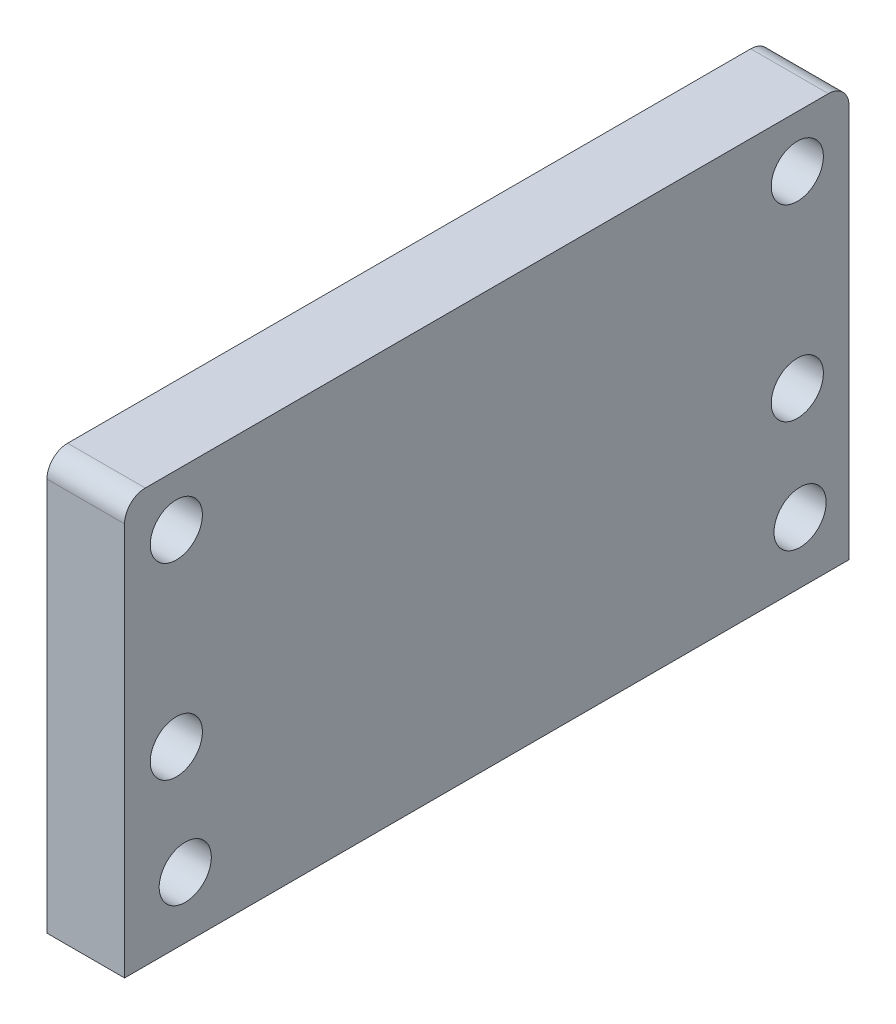
ISO-10303-21;
HEADER;
FILE_DESCRIPTION(('STEP AP214'),'2;1');
FILE_NAME('part.step','',(''),(''),'','','');
FILE_SCHEMA(('AUTOMOTIVE_DESIGN { 1 0 10303 214 1 1 1 1 }'));
ENDSEC;
DATA;
#1=APPLICATION_CONTEXT('core data for automotive mechanical design processes');
#2=APPLICATION_PROTOCOL_DEFINITION('international standard','automotive_design',2000,#1);
#3=PRODUCT_CONTEXT('',#1,'mechanical');
#4=PRODUCT('Part','Part','',(#3));
#5=PRODUCT_RELATED_PRODUCT_CATEGORY('part','',(#4));
#6=PRODUCT_DEFINITION_FORMATION('','',#4);
#7=PRODUCT_DEFINITION_CONTEXT('part definition',#1,'design');
#8=PRODUCT_DEFINITION('design','',#6,#7);
#9=PRODUCT_DEFINITION_SHAPE('','',#8);
#10=(LENGTH_UNIT() NAMED_UNIT(*) SI_UNIT(.MILLI.,.METRE.));
#11=(NAMED_UNIT(*) PLANE_ANGLE_UNIT() SI_UNIT($,.RADIAN.));
#12=(NAMED_UNIT(*) SI_UNIT($,.STERADIAN.) SOLID_ANGLE_UNIT());
#13=UNCERTAINTY_MEASURE_WITH_UNIT(LENGTH_MEASURE(1.E-05),#10,'distance_accuracy_value','');
#14=(GEOMETRIC_REPRESENTATION_CONTEXT(3) GLOBAL_UNCERTAINTY_ASSIGNED_CONTEXT((#13)) GLOBAL_UNIT_ASSIGNED_CONTEXT((#10,
#11,#12)) REPRESENTATION_CONTEXT('',''));
#15=CARTESIAN_POINT('',(0.,0.,0.));
#16=DIRECTION('',(0.,0.,1.));
#17=DIRECTION('',(1.,0.,0.));
#18=AXIS2_PLACEMENT_3D('',#15,#16,#17);
#19=CARTESIAN_POINT('',(4.7625,22.86,41.91));
#20=DIRECTION('',(-1.,0.,0.));
#21=DIRECTION('',(0.,0.,1.));
#22=AXIS2_PLACEMENT_3D('',#19,#20,#21);
#23=CYLINDRICAL_SURFACE('',#22,2.54);
#24=DIRECTION('',(-1.,0.,0.));
#25=VECTOR('',#24,1.);
#26=CARTESIAN_POINT('',(4.7625,22.86,44.45));
#27=LINE('',#26,#25);
#28=CARTESIAN_POINT('',(4.7625,22.86,44.45));
#29=VERTEX_POINT('',#28);
#30=CARTESIAN_POINT('',(-4.7625,22.86,44.45));
#31=VERTEX_POINT('',#30);
#32=EDGE_CURVE('E110',#29,#31,#27,.T.);
#33=ORIENTED_EDGE('',*,*,#32,.F.);
#34=CARTESIAN_POINT('',(4.7625,22.86,41.91));
#35=DIRECTION('',(1.,0.,0.));
#36=DIRECTION('',(0.,0.,-1.));
#37=AXIS2_PLACEMENT_3D('',#34,#35,#36);
#38=CIRCLE('',#37,2.54);
#39=CARTESIAN_POINT('',(4.7625,25.4,41.91));
#40=VERTEX_POINT('',#39);
#41=EDGE_CURVE('E91',#40,#29,#38,.T.);
#42=ORIENTED_EDGE('',*,*,#41,.F.);
#43=DIRECTION('',(-1.,0.,0.));
#44=VECTOR('',#43,1.);
#45=CARTESIAN_POINT('',(4.7625,25.4,41.91));
#46=LINE('',#45,#44);
#47=CARTESIAN_POINT('',(-4.7625,25.4,41.91));
#48=VERTEX_POINT('',#47);
#49=EDGE_CURVE('E112',#48,#40,#46,.F.);
#50=ORIENTED_EDGE('',*,*,#49,.F.);
#51=CARTESIAN_POINT('',(-4.7625,22.86,41.91));
#52=DIRECTION('',(1.,0.,0.));
#53=DIRECTION('',(0.,0.,-1.));
#54=AXIS2_PLACEMENT_3D('',#51,#52,#53);
#55=CIRCLE('',#54,2.54);
#56=EDGE_CURVE('E121',#31,#48,#55,.F.);
#57=ORIENTED_EDGE('',*,*,#56,.F.);
#58=EDGE_LOOP('',(#33,#42,#50,#57));
#59=FACE_BOUND('',#58,.T.);
#60=ADVANCED_FACE('F33',(#59),#23,.T.);
#61=CARTESIAN_POINT('',(4.7625,-25.4,44.45));
#62=DIRECTION('',(0.,0.,-1.));
#63=DIRECTION('',(-1.,0.,0.));
#64=AXIS2_PLACEMENT_3D('',#61,#62,#63);
#65=PLANE('',#64);
#66=DIRECTION('',(0.,-1.,0.));
#67=VECTOR('',#66,1.);
#68=CARTESIAN_POINT('',(4.7625,-25.4,44.45));
#69=LINE('',#68,#67);
#70=CARTESIAN_POINT('',(4.7625,-25.4,44.45));
#71=VERTEX_POINT('',#70);
#72=EDGE_CURVE('E85',#29,#71,#69,.T.);
#73=ORIENTED_EDGE('',*,*,#72,.F.);
#74=ORIENTED_EDGE('',*,*,#32,.T.);
#75=DIRECTION('',(0.,-1.,0.));
#76=VECTOR('',#75,1.);
#77=CARTESIAN_POINT('',(-4.7625,-25.4,44.45));
#78=LINE('',#77,#76);
#79=CARTESIAN_POINT('',(-4.7625,-25.4,44.45));
#80=VERTEX_POINT('',#79);
#81=EDGE_CURVE('E108',#31,#80,#78,.T.);
#82=ORIENTED_EDGE('',*,*,#81,.T.);
#83=DIRECTION('',(-1.,0.,0.));
#84=VECTOR('',#83,1.);
#85=CARTESIAN_POINT('',(4.7625,-25.4,44.45));
#86=LINE('',#85,#84);
#87=EDGE_CURVE('E101',#71,#80,#86,.T.);
#88=ORIENTED_EDGE('',*,*,#87,.F.);
#89=EDGE_LOOP('',(#73,#74,#82,#88));
#90=FACE_BOUND('',#89,.T.);
#91=ADVANCED_FACE('F106',(#90),#65,.F.);
#92=CARTESIAN_POINT('',(4.7625,-25.4,-44.45));
#93=DIRECTION('',(0.,1.,0.));
#94=DIRECTION('',(0.,0.,1.));
#95=AXIS2_PLACEMENT_3D('',#92,#93,#94);
#96=PLANE('',#95);
#97=DIRECTION('',(0.,0.,-1.));
#98=VECTOR('',#97,1.);
#99=CARTESIAN_POINT('',(-4.7625,-25.4,-44.45));
#100=LINE('',#99,#98);
#101=CARTESIAN_POINT('',(-4.7625,-25.4,-44.45));
#102=VERTEX_POINT('',#101);
#103=EDGE_CURVE('E136',#80,#102,#100,.T.);
#104=ORIENTED_EDGE('',*,*,#103,.T.);
#105=DIRECTION('',(-1.,0.,0.));
#106=VECTOR('',#105,1.);
#107=CARTESIAN_POINT('',(4.7625,-25.4,-44.45));
#108=LINE('',#107,#106);
#109=CARTESIAN_POINT('',(4.7625,-25.4,-44.45));
#110=VERTEX_POINT('',#109);
#111=EDGE_CURVE('E103',#110,#102,#108,.T.);
#112=ORIENTED_EDGE('',*,*,#111,.F.);
#113=DIRECTION('',(0.,0.,-1.));
#114=VECTOR('',#113,1.);
#115=CARTESIAN_POINT('',(4.7625,-25.4,-44.45));
#116=LINE('',#115,#114);
#117=EDGE_CURVE('E88',#71,#110,#116,.T.);
#118=ORIENTED_EDGE('',*,*,#117,.F.);
#119=ORIENTED_EDGE('',*,*,#87,.T.);
#120=EDGE_LOOP('',(#104,#112,#118,#119));
#121=FACE_BOUND('',#120,.T.);
#122=ADVANCED_FACE('F100',(#121),#96,.F.);
#123=CARTESIAN_POINT('',(4.7625,-25.4,-44.45));
#124=DIRECTION('',(0.,0.,1.));
#125=DIRECTION('',(1.,0.,0.));
#126=AXIS2_PLACEMENT_3D('',#123,#124,#125);
#127=PLANE('',#126);
#128=DIRECTION('',(0.,1.,0.));
#129=VECTOR('',#128,1.);
#130=CARTESIAN_POINT('',(-4.7625,-25.4,-44.45));
#131=LINE('',#130,#129);
#132=CARTESIAN_POINT('',(-4.7625,22.86,-44.45));
#133=VERTEX_POINT('',#132);
#134=EDGE_CURVE('E135',#102,#133,#131,.T.);
#135=ORIENTED_EDGE('',*,*,#134,.T.);
#136=DIRECTION('',(-1.,0.,0.));
#137=VECTOR('',#136,1.);
#138=CARTESIAN_POINT('',(4.7625,22.86,-44.45));
#139=LINE('',#138,#137);
#140=CARTESIAN_POINT('',(4.7625,22.86,-44.45));
#141=VERTEX_POINT('',#140);
#142=EDGE_CURVE('E41',#133,#141,#139,.F.);
#143=ORIENTED_EDGE('',*,*,#142,.T.);
#144=DIRECTION('',(0.,1.,0.));
#145=VECTOR('',#144,1.);
#146=CARTESIAN_POINT('',(4.7625,-25.4,-44.45));
#147=LINE('',#146,#145);
#148=EDGE_CURVE('E104',#110,#141,#147,.T.);
#149=ORIENTED_EDGE('',*,*,#148,.F.);
#150=ORIENTED_EDGE('',*,*,#111,.T.);
#151=EDGE_LOOP('',(#135,#143,#149,#150));
#152=FACE_BOUND('',#151,.T.);
#153=ADVANCED_FACE('F225',(#152),#127,.F.);
#154=CARTESIAN_POINT('',(4.7625,25.4,-44.45));
#155=DIRECTION('',(0.,-1.,0.));
#156=DIRECTION('',(0.,0.,-1.));
#157=AXIS2_PLACEMENT_3D('',#154,#155,#156);
#158=PLANE('',#157);
#159=DIRECTION('',(0.,0.,1.));
#160=VECTOR('',#159,1.);
#161=CARTESIAN_POINT('',(4.7625,25.4,-44.45));
#162=LINE('',#161,#160);
#163=CARTESIAN_POINT('',(4.7625,25.4,-41.91));
#164=VERTEX_POINT('',#163);
#165=EDGE_CURVE('E114',#164,#40,#162,.T.);
#166=ORIENTED_EDGE('',*,*,#165,.F.);
#167=DIRECTION('',(-1.,0.,0.));
#168=VECTOR('',#167,1.);
#169=CARTESIAN_POINT('',(4.7625,25.4,-41.91));
#170=LINE('',#169,#168);
#171=CARTESIAN_POINT('',(-4.7625,25.4,-41.91));
#172=VERTEX_POINT('',#171);
#173=EDGE_CURVE('E124',#164,#172,#170,.T.);
#174=ORIENTED_EDGE('',*,*,#173,.T.);
#175=DIRECTION('',(0.,0.,1.));
#176=VECTOR('',#175,1.);
#177=CARTESIAN_POINT('',(-4.7625,25.4,-44.45));
#178=LINE('',#177,#176);
#179=EDGE_CURVE('E96',#172,#48,#178,.T.);
#180=ORIENTED_EDGE('',*,*,#179,.T.);
#181=ORIENTED_EDGE('',*,*,#49,.T.);
#182=EDGE_LOOP('',(#166,#174,#180,#181));
#183=FACE_BOUND('',#182,.T.);
#184=ADVANCED_FACE('F130',(#183),#158,.F.);
#185=CARTESIAN_POINT('',(4.7625,0.,0.));
#186=DIRECTION('',(1.,0.,0.));
#187=DIRECTION('',(0.,0.,-1.));
#188=AXIS2_PLACEMENT_3D('',#185,#186,#187);
#189=PLANE('',#188);
#190=CARTESIAN_POINT('',(4.7625,-17.8793279131071,-38.440338436633));
#191=DIRECTION('',(1.,0.,0.));
#192=DIRECTION('',(0.,0.,-1.));
#193=AXIS2_PLACEMENT_3D('',#190,#191,#192);
#194=CIRCLE('',#193,3.2);
#195=CARTESIAN_POINT('',(4.7625,-17.8793279131071,-41.640338436633));
#196=VERTEX_POINT('',#195);
#197=EDGE_CURVE('E174',#196,#196,#194,.T.);
#198=ORIENTED_EDGE('',*,*,#197,.F.);
#199=EDGE_LOOP('',(#198));
#200=FACE_BOUND('',#199,.T.);
#201=CARTESIAN_POINT('',(4.7625,-17.8793279131071,37.0021113812022));
#202=DIRECTION('',(1.,0.,0.));
#203=DIRECTION('',(0.,0.,-1.));
#204=AXIS2_PLACEMENT_3D('',#201,#202,#203);
#205=CIRCLE('',#204,3.2);
#206=CARTESIAN_POINT('',(4.7625,-17.8793279131071,33.8021113812022));
#207=VERTEX_POINT('',#206);
#208=EDGE_CURVE('E168',#207,#207,#205,.T.);
#209=ORIENTED_EDGE('',*,*,#208,.F.);
#210=EDGE_LOOP('',(#209));
#211=FACE_BOUND('',#210,.T.);
#212=CARTESIAN_POINT('',(4.7625,-3.99999999999999,-38.1));
#213=DIRECTION('',(1.,0.,0.));
#214=DIRECTION('',(0.,0.,-1.));
#215=AXIS2_PLACEMENT_3D('',#212,#213,#214);
#216=CIRCLE('',#215,3.2);
#217=CARTESIAN_POINT('',(4.7625,-3.99999999999999,-41.3));
#218=VERTEX_POINT('',#217);
#219=EDGE_CURVE('E162',#218,#218,#216,.T.);
#220=ORIENTED_EDGE('',*,*,#219,.F.);
#221=EDGE_LOOP('',(#220));
#222=FACE_BOUND('',#221,.T.);
#223=CARTESIAN_POINT('',(4.7625,-3.99999999999999,38.1));
#224=DIRECTION('',(1.,0.,0.));
#225=DIRECTION('',(0.,0.,-1.));
#226=AXIS2_PLACEMENT_3D('',#223,#224,#225);
#227=CIRCLE('',#226,3.2);
#228=CARTESIAN_POINT('',(4.7625,-3.99999999999999,34.9));
#229=VERTEX_POINT('',#228);
#230=EDGE_CURVE('E156',#229,#229,#227,.T.);
#231=ORIENTED_EDGE('',*,*,#230,.F.);
#232=EDGE_LOOP('',(#231));
#233=FACE_BOUND('',#232,.T.);
#234=CARTESIAN_POINT('',(4.7625,19.05,-38.1));
#235=DIRECTION('',(1.,0.,0.));
#236=DIRECTION('',(0.,0.,-1.));
#237=AXIS2_PLACEMENT_3D('',#234,#235,#236);
#238=CIRCLE('',#237,3.20000000000001);
#239=CARTESIAN_POINT('',(4.7625,19.05,-41.3));
#240=VERTEX_POINT('',#239);
#241=EDGE_CURVE('E150',#240,#240,#238,.T.);
#242=ORIENTED_EDGE('',*,*,#241,.F.);
#243=EDGE_LOOP('',(#242));
#244=FACE_BOUND('',#243,.T.);
#245=CARTESIAN_POINT('',(4.7625,19.05,38.1));
#246=DIRECTION('',(1.,0.,0.));
#247=DIRECTION('',(0.,0.,-1.));
#248=AXIS2_PLACEMENT_3D('',#245,#246,#247);
#249=CIRCLE('',#248,3.2);
#250=CARTESIAN_POINT('',(4.7625,19.05,34.9));
#251=VERTEX_POINT('',#250);
#252=EDGE_CURVE('E144',#251,#251,#249,.T.);
#253=ORIENTED_EDGE('',*,*,#252,.F.);
#254=EDGE_LOOP('',(#253));
#255=FACE_BOUND('',#254,.T.);
#256=ORIENTED_EDGE('',*,*,#148,.T.);
#257=CARTESIAN_POINT('',(4.7625,22.86,-41.91));
#258=DIRECTION('',(1.,0.,0.));
#259=DIRECTION('',(0.,0.,-1.));
#260=AXIS2_PLACEMENT_3D('',#257,#258,#259);
#261=CIRCLE('',#260,2.54);
#262=EDGE_CURVE('E11',#141,#164,#261,.T.);
#263=ORIENTED_EDGE('',*,*,#262,.T.);
#264=ORIENTED_EDGE('',*,*,#165,.T.);
#265=ORIENTED_EDGE('',*,*,#41,.T.);
#266=ORIENTED_EDGE('',*,*,#72,.T.);
#267=ORIENTED_EDGE('',*,*,#117,.T.);
#268=EDGE_LOOP('',(#256,#263,#264,#265,#266,#267));
#269=FACE_BOUND('',#268,.T.);
#270=ADVANCED_FACE('F87',(#200,#211,#222,#233,#244,#255,#269),#189,.T.);
#271=CARTESIAN_POINT('',(-4.7625,0.,0.));
#272=DIRECTION('',(1.,0.,0.));
#273=DIRECTION('',(0.,0.,-1.));
#274=AXIS2_PLACEMENT_3D('',#271,#272,#273);
#275=PLANE('',#274);
#276=CARTESIAN_POINT('',(-4.7625,-17.8793279131071,-38.440338436633));
#277=DIRECTION('',(1.,0.,0.));
#278=DIRECTION('',(0.,0.,-1.));
#279=AXIS2_PLACEMENT_3D('',#276,#277,#278);
#280=CIRCLE('',#279,3.2);
#281=CARTESIAN_POINT('',(-4.7625,-17.8793279131071,-41.640338436633));
#282=VERTEX_POINT('',#281);
#283=EDGE_CURVE('E171',#282,#282,#280,.T.);
#284=ORIENTED_EDGE('',*,*,#283,.T.);
#285=EDGE_LOOP('',(#284));
#286=FACE_BOUND('',#285,.T.);
#287=CARTESIAN_POINT('',(-4.7625,-17.8793279131071,37.0021113812022));
#288=DIRECTION('',(1.,0.,0.));
#289=DIRECTION('',(0.,0.,-1.));
#290=AXIS2_PLACEMENT_3D('',#287,#288,#289);
#291=CIRCLE('',#290,3.2);
#292=CARTESIAN_POINT('',(-4.7625,-17.8793279131071,33.8021113812022));
#293=VERTEX_POINT('',#292);
#294=EDGE_CURVE('E165',#293,#293,#291,.T.);
#295=ORIENTED_EDGE('',*,*,#294,.T.);
#296=EDGE_LOOP('',(#295));
#297=FACE_BOUND('',#296,.T.);
#298=CARTESIAN_POINT('',(-4.7625,-3.99999999999999,-38.1));
#299=DIRECTION('',(1.,0.,0.));
#300=DIRECTION('',(0.,0.,-1.));
#301=AXIS2_PLACEMENT_3D('',#298,#299,#300);
#302=CIRCLE('',#301,3.2);
#303=CARTESIAN_POINT('',(-4.7625,-3.99999999999999,-41.3));
#304=VERTEX_POINT('',#303);
#305=EDGE_CURVE('E159',#304,#304,#302,.T.);
#306=ORIENTED_EDGE('',*,*,#305,.T.);
#307=EDGE_LOOP('',(#306));
#308=FACE_BOUND('',#307,.T.);
#309=CARTESIAN_POINT('',(-4.7625,-3.99999999999999,38.1));
#310=DIRECTION('',(1.,0.,0.));
#311=DIRECTION('',(0.,0.,-1.));
#312=AXIS2_PLACEMENT_3D('',#309,#310,#311);
#313=CIRCLE('',#312,3.2);
#314=CARTESIAN_POINT('',(-4.7625,-3.99999999999999,34.9));
#315=VERTEX_POINT('',#314);
#316=EDGE_CURVE('E153',#315,#315,#313,.T.);
#317=ORIENTED_EDGE('',*,*,#316,.T.);
#318=EDGE_LOOP('',(#317));
#319=FACE_BOUND('',#318,.T.);
#320=CARTESIAN_POINT('',(-4.7625,19.05,-38.1));
#321=DIRECTION('',(1.,0.,0.));
#322=DIRECTION('',(0.,0.,-1.));
#323=AXIS2_PLACEMENT_3D('',#320,#321,#322);
#324=CIRCLE('',#323,3.20000000000001);
#325=CARTESIAN_POINT('',(-4.7625,19.05,-41.3));
#326=VERTEX_POINT('',#325);
#327=EDGE_CURVE('E147',#326,#326,#324,.T.);
#328=ORIENTED_EDGE('',*,*,#327,.T.);
#329=EDGE_LOOP('',(#328));
#330=FACE_BOUND('',#329,.T.);
#331=CARTESIAN_POINT('',(-4.7625,19.05,38.1));
#332=DIRECTION('',(1.,0.,0.));
#333=DIRECTION('',(0.,0.,-1.));
#334=AXIS2_PLACEMENT_3D('',#331,#332,#333);
#335=CIRCLE('',#334,3.2);
#336=CARTESIAN_POINT('',(-4.7625,19.05,34.9));
#337=VERTEX_POINT('',#336);
#338=EDGE_CURVE('E141',#337,#337,#335,.T.);
#339=ORIENTED_EDGE('',*,*,#338,.T.);
#340=EDGE_LOOP('',(#339));
#341=FACE_BOUND('',#340,.T.);
#342=ORIENTED_EDGE('',*,*,#179,.F.);
#343=CARTESIAN_POINT('',(-4.7625,22.86,-41.91));
#344=DIRECTION('',(1.,0.,0.));
#345=DIRECTION('',(0.,0.,-1.));
#346=AXIS2_PLACEMENT_3D('',#343,#344,#345);
#347=CIRCLE('',#346,2.54);
#348=EDGE_CURVE('E55',#172,#133,#347,.F.);
#349=ORIENTED_EDGE('',*,*,#348,.T.);
#350=ORIENTED_EDGE('',*,*,#134,.F.);
#351=ORIENTED_EDGE('',*,*,#103,.F.);
#352=ORIENTED_EDGE('',*,*,#81,.F.);
#353=ORIENTED_EDGE('',*,*,#56,.T.);
#354=EDGE_LOOP('',(#342,#349,#350,#351,#352,#353));
#355=FACE_BOUND('',#354,.T.);
#356=ADVANCED_FACE('F133',(#286,#297,#308,#319,#330,#341,#355),#275,.F.);
#357=CARTESIAN_POINT('',(-4.7625,19.05,38.1));
#358=DIRECTION('',(1.,0.,0.));
#359=DIRECTION('',(0.,0.,-1.));
#360=AXIS2_PLACEMENT_3D('',#357,#358,#359);
#361=CYLINDRICAL_SURFACE('',#360,3.2);
#362=ORIENTED_EDGE('',*,*,#338,.F.);
#363=EDGE_LOOP('',(#362));
#364=FACE_BOUND('',#363,.T.);
#365=ORIENTED_EDGE('',*,*,#252,.T.);
#366=EDGE_LOOP('',(#365));
#367=FACE_BOUND('',#366,.T.);
#368=ADVANCED_FACE('F202',(#364,#367),#361,.F.);
#369=CARTESIAN_POINT('',(-4.7625,19.05,-38.1));
#370=DIRECTION('',(1.,0.,0.));
#371=DIRECTION('',(0.,0.,-1.));
#372=AXIS2_PLACEMENT_3D('',#369,#370,#371);
#373=CYLINDRICAL_SURFACE('',#372,3.20000000000001);
#374=ORIENTED_EDGE('',*,*,#327,.F.);
#375=EDGE_LOOP('',(#374));
#376=FACE_BOUND('',#375,.T.);
#377=ORIENTED_EDGE('',*,*,#241,.T.);
#378=EDGE_LOOP('',(#377));
#379=FACE_BOUND('',#378,.T.);
#380=ADVANCED_FACE('F204',(#376,#379),#373,.F.);
#381=CARTESIAN_POINT('',(-4.7625,-3.99999999999999,38.1));
#382=DIRECTION('',(1.,0.,0.));
#383=DIRECTION('',(0.,0.,-1.));
#384=AXIS2_PLACEMENT_3D('',#381,#382,#383);
#385=CYLINDRICAL_SURFACE('',#384,3.2);
#386=ORIENTED_EDGE('',*,*,#316,.F.);
#387=EDGE_LOOP('',(#386));
#388=FACE_BOUND('',#387,.T.);
#389=ORIENTED_EDGE('',*,*,#230,.T.);
#390=EDGE_LOOP('',(#389));
#391=FACE_BOUND('',#390,.T.);
#392=ADVANCED_FACE('F211',(#388,#391),#385,.F.);
#393=CARTESIAN_POINT('',(-4.7625,-3.99999999999999,-38.1));
#394=DIRECTION('',(1.,0.,0.));
#395=DIRECTION('',(0.,0.,-1.));
#396=AXIS2_PLACEMENT_3D('',#393,#394,#395);
#397=CYLINDRICAL_SURFACE('',#396,3.2);
#398=ORIENTED_EDGE('',*,*,#305,.F.);
#399=EDGE_LOOP('',(#398));
#400=FACE_BOUND('',#399,.T.);
#401=ORIENTED_EDGE('',*,*,#219,.T.);
#402=EDGE_LOOP('',(#401));
#403=FACE_BOUND('',#402,.T.);
#404=ADVANCED_FACE('F266',(#400,#403),#397,.F.);
#405=CARTESIAN_POINT('',(4.7625,22.86,-41.91));
#406=DIRECTION('',(-1.,0.,0.));
#407=DIRECTION('',(0.,0.,1.));
#408=AXIS2_PLACEMENT_3D('',#405,#406,#407);
#409=CYLINDRICAL_SURFACE('',#408,2.54);
#410=ORIENTED_EDGE('',*,*,#262,.F.);
#411=ORIENTED_EDGE('',*,*,#142,.F.);
#412=ORIENTED_EDGE('',*,*,#348,.F.);
#413=ORIENTED_EDGE('',*,*,#173,.F.);
#414=EDGE_LOOP('',(#410,#411,#412,#413));
#415=FACE_BOUND('',#414,.T.);
#416=ADVANCED_FACE('F35',(#415),#409,.T.);
#417=CARTESIAN_POINT('',(-4.7625,-17.8793279131071,37.0021113812022));
#418=DIRECTION('',(1.,0.,0.));
#419=DIRECTION('',(0.,0.,-1.));
#420=AXIS2_PLACEMENT_3D('',#417,#418,#419);
#421=CYLINDRICAL_SURFACE('',#420,3.2);
#422=ORIENTED_EDGE('',*,*,#294,.F.);
#423=EDGE_LOOP('',(#422));
#424=FACE_BOUND('',#423,.T.);
#425=ORIENTED_EDGE('',*,*,#208,.T.);
#426=EDGE_LOOP('',(#425));
#427=FACE_BOUND('',#426,.T.);
#428=ADVANCED_FACE('F185',(#424,#427),#421,.F.);
#429=CARTESIAN_POINT('',(-4.7625,-17.8793279131071,-38.440338436633));
#430=DIRECTION('',(1.,0.,0.));
#431=DIRECTION('',(0.,0.,-1.));
#432=AXIS2_PLACEMENT_3D('',#429,#430,#431);
#433=CYLINDRICAL_SURFACE('',#432,3.2);
#434=ORIENTED_EDGE('',*,*,#283,.F.);
#435=EDGE_LOOP('',(#434));
#436=FACE_BOUND('',#435,.T.);
#437=ORIENTED_EDGE('',*,*,#197,.T.);
#438=EDGE_LOOP('',(#437));
#439=FACE_BOUND('',#438,.T.);
#440=ADVANCED_FACE('F182',(#436,#439),#433,.F.);
#441=CLOSED_SHELL('',(#60,#91,#122,#153,#184,#270,#356,#368,#380,#392,#404,#416,#428,#440));
#442=MANIFOLD_SOLID_BREP('B2',#441);
#443=ADVANCED_BREP_SHAPE_REPRESENTATION('',(#18,#442),#14);
#444=SHAPE_DEFINITION_REPRESENTATION(#9,#443);
ENDSEC;
END-ISO-10303-21;
